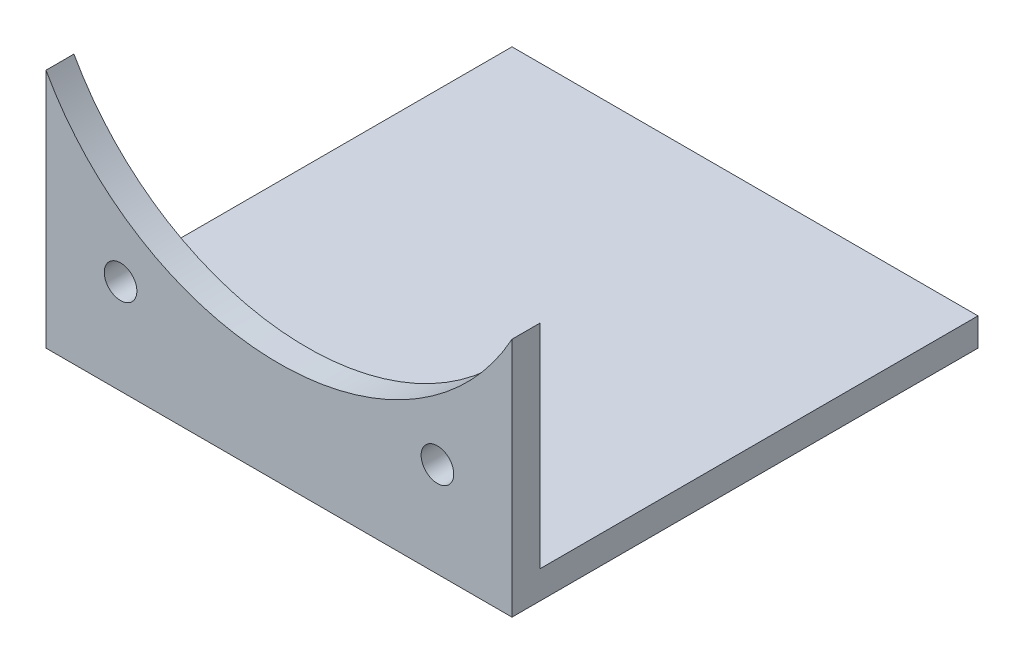
ISO-10303-21;
HEADER;
FILE_DESCRIPTION(('STEP AP214'),'2;1');
FILE_NAME('part.step','',(''),(''),'','','');
FILE_SCHEMA(('AUTOMOTIVE_DESIGN { 1 0 10303 214 1 1 1 1 }'));
ENDSEC;
DATA;
#1=APPLICATION_CONTEXT('core data for automotive mechanical design processes');
#2=APPLICATION_PROTOCOL_DEFINITION('international standard','automotive_design',2000,#1);
#3=PRODUCT_CONTEXT('',#1,'mechanical');
#4=PRODUCT('Part','Part','',(#3));
#5=PRODUCT_RELATED_PRODUCT_CATEGORY('part','',(#4));
#6=PRODUCT_DEFINITION_FORMATION('','',#4);
#7=PRODUCT_DEFINITION_CONTEXT('part definition',#1,'design');
#8=PRODUCT_DEFINITION('design','',#6,#7);
#9=PRODUCT_DEFINITION_SHAPE('','',#8);
#10=(LENGTH_UNIT() NAMED_UNIT(*) SI_UNIT(.MILLI.,.METRE.));
#11=(NAMED_UNIT(*) PLANE_ANGLE_UNIT() SI_UNIT($,.RADIAN.));
#12=(NAMED_UNIT(*) SI_UNIT($,.STERADIAN.) SOLID_ANGLE_UNIT());
#13=UNCERTAINTY_MEASURE_WITH_UNIT(LENGTH_MEASURE(1.E-05),#10,'distance_accuracy_value','');
#14=(GEOMETRIC_REPRESENTATION_CONTEXT(3) GLOBAL_UNCERTAINTY_ASSIGNED_CONTEXT((#13)) GLOBAL_UNIT_ASSIGNED_CONTEXT((#10,
#11,#12)) REPRESENTATION_CONTEXT('',''));
#15=CARTESIAN_POINT('',(0.,0.,0.));
#16=DIRECTION('',(0.,0.,1.));
#17=DIRECTION('',(1.,0.,0.));
#18=AXIS2_PLACEMENT_3D('',#15,#16,#17);
#19=CARTESIAN_POINT('',(25.,0.,0.));
#20=DIRECTION('',(0.,0.,1.));
#21=DIRECTION('',(1.,0.,0.));
#22=AXIS2_PLACEMENT_3D('',#19,#20,#21);
#23=PLANE('',#22);
#24=CARTESIAN_POINT('',(0.,39.6174123424691,0.));
#25=DIRECTION('',(0.,0.,-1.));
#26=DIRECTION('',(-1.,0.,0.));
#27=AXIS2_PLACEMENT_3D('',#24,#25,#26);
#28=CIRCLE('',#27,28.55);
#29=CARTESIAN_POINT('',(25.,25.8296460259115,0.));
#30=VERTEX_POINT('',#29);
#31=CARTESIAN_POINT('',(-25.,25.8296460259115,0.));
#32=VERTEX_POINT('',#31);
#33=EDGE_CURVE('E130',#30,#32,#28,.T.);
#34=ORIENTED_EDGE('',*,*,#33,.T.);
#35=DIRECTION('',(0.,1.,0.));
#36=VECTOR('',#35,1.);
#37=CARTESIAN_POINT('',(-25.,0.,0.));
#38=LINE('',#37,#36);
#39=CARTESIAN_POINT('',(-25.,0.,0.));
#40=VERTEX_POINT('',#39);
#41=EDGE_CURVE('E112',#40,#32,#38,.T.);
#42=ORIENTED_EDGE('',*,*,#41,.F.);
#43=DIRECTION('',(-1.,0.,0.));
#44=VECTOR('',#43,1.);
#45=CARTESIAN_POINT('',(25.,0.,0.));
#46=LINE('',#45,#44);
#47=CARTESIAN_POINT('',(25.,0.,0.));
#48=VERTEX_POINT('',#47);
#49=EDGE_CURVE('E41',#48,#40,#46,.T.);
#50=ORIENTED_EDGE('',*,*,#49,.F.);
#51=DIRECTION('',(0.,1.,0.));
#52=VECTOR('',#51,1.);
#53=CARTESIAN_POINT('',(25.,0.,0.));
#54=LINE('',#53,#52);
#55=EDGE_CURVE('E111',#48,#30,#54,.T.);
#56=ORIENTED_EDGE('',*,*,#55,.T.);
#57=EDGE_LOOP('',(#34,#42,#50,#56));
#58=FACE_BOUND('',#57,.T.);
#59=CARTESIAN_POINT('',(17.,10.1725486137982,0.));
#60=DIRECTION('',(0.,0.,-1.));
#61=DIRECTION('',(-1.,0.,0.));
#62=AXIS2_PLACEMENT_3D('',#59,#60,#61);
#63=CIRCLE('',#62,1.75);
#64=CARTESIAN_POINT('',(15.25,10.1725486137982,0.));
#65=VERTEX_POINT('',#64);
#66=EDGE_CURVE('E135',#65,#65,#63,.T.);
#67=ORIENTED_EDGE('',*,*,#66,.T.);
#68=EDGE_LOOP('',(#67));
#69=FACE_BOUND('',#68,.T.);
#70=CARTESIAN_POINT('',(-17.,10.1725486137982,0.));
#71=DIRECTION('',(0.,0.,-1.));
#72=DIRECTION('',(-1.,0.,0.));
#73=AXIS2_PLACEMENT_3D('',#70,#71,#72);
#74=CIRCLE('',#73,1.75);
#75=CARTESIAN_POINT('',(-18.75,10.1725486137982,0.));
#76=VERTEX_POINT('',#75);
#77=EDGE_CURVE('E126',#76,#76,#74,.T.);
#78=ORIENTED_EDGE('',*,*,#77,.T.);
#79=EDGE_LOOP('',(#78));
#80=FACE_BOUND('',#79,.T.);
#81=ADVANCED_FACE('F33',(#58,#69,#80),#23,.T.);
#82=CARTESIAN_POINT('',(-25.,0.,0.));
#83=DIRECTION('',(1.,0.,0.));
#84=DIRECTION('',(0.,0.,-1.));
#85=AXIS2_PLACEMENT_3D('',#82,#83,#84);
#86=PLANE('',#85);
#87=ORIENTED_EDGE('',*,*,#41,.T.);
#88=DIRECTION('',(0.,0.,-1.));
#89=VECTOR('',#88,1.);
#90=CARTESIAN_POINT('',(-25.,25.8296460259115,0.));
#91=LINE('',#90,#89);
#92=CARTESIAN_POINT('',(-25.,25.8296460259115,-3.));
#93=VERTEX_POINT('',#92);
#94=EDGE_CURVE('E105',#32,#93,#91,.T.);
#95=ORIENTED_EDGE('',*,*,#94,.T.);
#96=DIRECTION('',(0.,1.,0.));
#97=VECTOR('',#96,1.);
#98=CARTESIAN_POINT('',(-25.,0.,-3.));
#99=LINE('',#98,#97);
#100=CARTESIAN_POINT('',(-25.,3.,-3.));
#101=VERTEX_POINT('',#100);
#102=EDGE_CURVE('E88',#101,#93,#99,.T.);
#103=ORIENTED_EDGE('',*,*,#102,.F.);
#104=DIRECTION('',(0.,0.,-1.));
#105=VECTOR('',#104,1.);
#106=CARTESIAN_POINT('',(-25.,3.,-3.));
#107=LINE('',#106,#105);
#108=CARTESIAN_POINT('',(-25.,3.,-50.));
#109=VERTEX_POINT('',#108);
#110=EDGE_CURVE('E101',#101,#109,#107,.T.);
#111=ORIENTED_EDGE('',*,*,#110,.T.);
#112=DIRECTION('',(0.,1.,0.));
#113=VECTOR('',#112,1.);
#114=CARTESIAN_POINT('',(-25.,0.,-50.));
#115=LINE('',#114,#113);
#116=CARTESIAN_POINT('',(-25.,0.,-50.));
#117=VERTEX_POINT('',#116);
#118=EDGE_CURVE('E94',#117,#109,#115,.T.);
#119=ORIENTED_EDGE('',*,*,#118,.F.);
#120=DIRECTION('',(0.,0.,-1.));
#121=VECTOR('',#120,1.);
#122=CARTESIAN_POINT('',(-25.,0.,0.));
#123=LINE('',#122,#121);
#124=EDGE_CURVE('E77',#40,#117,#123,.T.);
#125=ORIENTED_EDGE('',*,*,#124,.F.);
#126=EDGE_LOOP('',(#87,#95,#103,#111,#119,#125));
#127=FACE_BOUND('',#126,.T.);
#128=ADVANCED_FACE('F99',(#127),#86,.F.);
#129=CARTESIAN_POINT('',(25.,0.,0.));
#130=DIRECTION('',(1.,0.,0.));
#131=DIRECTION('',(0.,0.,-1.));
#132=AXIS2_PLACEMENT_3D('',#129,#130,#131);
#133=PLANE('',#132);
#134=DIRECTION('',(0.,0.,-1.));
#135=VECTOR('',#134,1.);
#136=CARTESIAN_POINT('',(25.,25.8296460259115,0.));
#137=LINE('',#136,#135);
#138=CARTESIAN_POINT('',(25.,25.8296460259115,-3.));
#139=VERTEX_POINT('',#138);
#140=EDGE_CURVE('E48',#30,#139,#137,.T.);
#141=ORIENTED_EDGE('',*,*,#140,.F.);
#142=ORIENTED_EDGE('',*,*,#55,.F.);
#143=DIRECTION('',(0.,0.,-1.));
#144=VECTOR('',#143,1.);
#145=CARTESIAN_POINT('',(25.,0.,0.));
#146=LINE('',#145,#144);
#147=CARTESIAN_POINT('',(25.,0.,-50.));
#148=VERTEX_POINT('',#147);
#149=EDGE_CURVE('E114',#48,#148,#146,.T.);
#150=ORIENTED_EDGE('',*,*,#149,.T.);
#151=DIRECTION('',(0.,1.,0.));
#152=VECTOR('',#151,1.);
#153=CARTESIAN_POINT('',(25.,0.,-50.));
#154=LINE('',#153,#152);
#155=CARTESIAN_POINT('',(25.,3.,-50.));
#156=VERTEX_POINT('',#155);
#157=EDGE_CURVE('E96',#148,#156,#154,.T.);
#158=ORIENTED_EDGE('',*,*,#157,.T.);
#159=DIRECTION('',(0.,0.,-1.));
#160=VECTOR('',#159,1.);
#161=CARTESIAN_POINT('',(25.,3.,-3.));
#162=LINE('',#161,#160);
#163=CARTESIAN_POINT('',(25.,3.,-3.));
#164=VERTEX_POINT('',#163);
#165=EDGE_CURVE('E102',#164,#156,#162,.T.);
#166=ORIENTED_EDGE('',*,*,#165,.F.);
#167=DIRECTION('',(0.,1.,0.));
#168=VECTOR('',#167,1.);
#169=CARTESIAN_POINT('',(25.,0.,-3.));
#170=LINE('',#169,#168);
#171=EDGE_CURVE('E119',#164,#139,#170,.T.);
#172=ORIENTED_EDGE('',*,*,#171,.T.);
#173=EDGE_LOOP('',(#141,#142,#150,#158,#166,#172));
#174=FACE_BOUND('',#173,.T.);
#175=ADVANCED_FACE('F157',(#174),#133,.T.);
#176=CARTESIAN_POINT('',(25.,0.,-3.));
#177=DIRECTION('',(0.,0.,1.));
#178=DIRECTION('',(1.,0.,0.));
#179=AXIS2_PLACEMENT_3D('',#176,#177,#178);
#180=PLANE('',#179);
#181=CARTESIAN_POINT('',(17.,10.1725486137982,-3.));
#182=DIRECTION('',(0.,0.,-1.));
#183=DIRECTION('',(-1.,0.,0.));
#184=AXIS2_PLACEMENT_3D('',#181,#182,#183);
#185=CIRCLE('',#184,1.75);
#186=CARTESIAN_POINT('',(15.25,10.1725486137982,-3.));
#187=VERTEX_POINT('',#186);
#188=EDGE_CURVE('E138',#187,#187,#185,.T.);
#189=ORIENTED_EDGE('',*,*,#188,.F.);
#190=EDGE_LOOP('',(#189));
#191=FACE_BOUND('',#190,.T.);
#192=CARTESIAN_POINT('',(-17.,10.1725486137982,-3.));
#193=DIRECTION('',(0.,0.,-1.));
#194=DIRECTION('',(-1.,0.,0.));
#195=AXIS2_PLACEMENT_3D('',#192,#193,#194);
#196=CIRCLE('',#195,1.75);
#197=CARTESIAN_POINT('',(-18.75,10.1725486137982,-3.));
#198=VERTEX_POINT('',#197);
#199=EDGE_CURVE('E127',#198,#198,#196,.T.);
#200=ORIENTED_EDGE('',*,*,#199,.F.);
#201=EDGE_LOOP('',(#200));
#202=FACE_BOUND('',#201,.T.);
#203=ORIENTED_EDGE('',*,*,#102,.T.);
#204=CARTESIAN_POINT('',(0.,39.6174123424691,-3.));
#205=DIRECTION('',(0.,0.,-1.));
#206=DIRECTION('',(-1.,0.,0.));
#207=AXIS2_PLACEMENT_3D('',#204,#205,#206);
#208=CIRCLE('',#207,28.55);
#209=EDGE_CURVE('E133',#139,#93,#208,.T.);
#210=ORIENTED_EDGE('',*,*,#209,.F.);
#211=ORIENTED_EDGE('',*,*,#171,.F.);
#212=DIRECTION('',(-1.,0.,0.));
#213=VECTOR('',#212,1.);
#214=CARTESIAN_POINT('',(25.,3.,-3.));
#215=LINE('',#214,#213);
#216=EDGE_CURVE('E11',#164,#101,#215,.T.);
#217=ORIENTED_EDGE('',*,*,#216,.T.);
#218=EDGE_LOOP('',(#203,#210,#211,#217));
#219=FACE_BOUND('',#218,.T.);
#220=ADVANCED_FACE('F154',(#191,#202,#219),#180,.F.);
#221=CARTESIAN_POINT('',(25.,0.,0.));
#222=DIRECTION('',(0.,1.,0.));
#223=DIRECTION('',(0.,0.,1.));
#224=AXIS2_PLACEMENT_3D('',#221,#222,#223);
#225=PLANE('',#224);
#226=ORIENTED_EDGE('',*,*,#124,.T.);
#227=DIRECTION('',(-1.,0.,0.));
#228=VECTOR('',#227,1.);
#229=CARTESIAN_POINT('',(25.,0.,-50.));
#230=LINE('',#229,#228);
#231=EDGE_CURVE('E81',#148,#117,#230,.T.);
#232=ORIENTED_EDGE('',*,*,#231,.F.);
#233=ORIENTED_EDGE('',*,*,#149,.F.);
#234=ORIENTED_EDGE('',*,*,#49,.T.);
#235=EDGE_LOOP('',(#226,#232,#233,#234));
#236=FACE_BOUND('',#235,.T.);
#237=ADVANCED_FACE('F79',(#236),#225,.F.);
#238=CARTESIAN_POINT('',(25.,0.,-50.));
#239=DIRECTION('',(0.,0.,1.));
#240=DIRECTION('',(1.,0.,0.));
#241=AXIS2_PLACEMENT_3D('',#238,#239,#240);
#242=PLANE('',#241);
#243=ORIENTED_EDGE('',*,*,#118,.T.);
#244=DIRECTION('',(-1.,0.,0.));
#245=VECTOR('',#244,1.);
#246=CARTESIAN_POINT('',(25.,3.,-50.));
#247=LINE('',#246,#245);
#248=EDGE_CURVE('E97',#156,#109,#247,.T.);
#249=ORIENTED_EDGE('',*,*,#248,.F.);
#250=ORIENTED_EDGE('',*,*,#157,.F.);
#251=ORIENTED_EDGE('',*,*,#231,.T.);
#252=EDGE_LOOP('',(#243,#249,#250,#251));
#253=FACE_BOUND('',#252,.T.);
#254=ADVANCED_FACE('F92',(#253),#242,.F.);
#255=CARTESIAN_POINT('',(25.,3.,-3.));
#256=DIRECTION('',(0.,1.,0.));
#257=DIRECTION('',(0.,0.,1.));
#258=AXIS2_PLACEMENT_3D('',#255,#256,#257);
#259=PLANE('',#258);
#260=ORIENTED_EDGE('',*,*,#110,.F.);
#261=ORIENTED_EDGE('',*,*,#216,.F.);
#262=ORIENTED_EDGE('',*,*,#165,.T.);
#263=ORIENTED_EDGE('',*,*,#248,.T.);
#264=EDGE_LOOP('',(#260,#261,#262,#263));
#265=FACE_BOUND('',#264,.T.);
#266=ADVANCED_FACE('F35',(#265),#259,.T.);
#267=CARTESIAN_POINT('',(-17.,10.1725486137982,0.));
#268=DIRECTION('',(0.,0.,-1.));
#269=DIRECTION('',(-1.,0.,0.));
#270=AXIS2_PLACEMENT_3D('',#267,#268,#269);
#271=CYLINDRICAL_SURFACE('',#270,1.75);
#272=ORIENTED_EDGE('',*,*,#77,.F.);
#273=EDGE_LOOP('',(#272));
#274=FACE_BOUND('',#273,.T.);
#275=ORIENTED_EDGE('',*,*,#199,.T.);
#276=EDGE_LOOP('',(#275));
#277=FACE_BOUND('',#276,.T.);
#278=ADVANCED_FACE('F150',(#274,#277),#271,.F.);
#279=CARTESIAN_POINT('',(17.,10.1725486137982,0.));
#280=DIRECTION('',(0.,0.,-1.));
#281=DIRECTION('',(-1.,0.,0.));
#282=AXIS2_PLACEMENT_3D('',#279,#280,#281);
#283=CYLINDRICAL_SURFACE('',#282,1.75);
#284=ORIENTED_EDGE('',*,*,#66,.F.);
#285=EDGE_LOOP('',(#284));
#286=FACE_BOUND('',#285,.T.);
#287=ORIENTED_EDGE('',*,*,#188,.T.);
#288=EDGE_LOOP('',(#287));
#289=FACE_BOUND('',#288,.T.);
#290=ADVANCED_FACE('F146',(#286,#289),#283,.F.);
#291=CARTESIAN_POINT('',(0.,39.6174123424691,0.));
#292=DIRECTION('',(0.,0.,-1.));
#293=DIRECTION('',(-1.,0.,0.));
#294=AXIS2_PLACEMENT_3D('',#291,#292,#293);
#295=CYLINDRICAL_SURFACE('',#294,28.55);
#296=ORIENTED_EDGE('',*,*,#33,.F.);
#297=ORIENTED_EDGE('',*,*,#140,.T.);
#298=ORIENTED_EDGE('',*,*,#209,.T.);
#299=ORIENTED_EDGE('',*,*,#94,.F.);
#300=EDGE_LOOP('',(#296,#297,#298,#299));
#301=FACE_BOUND('',#300,.T.);
#302=ADVANCED_FACE('F149',(#301),#295,.F.);
#303=CLOSED_SHELL('',(#81,#128,#175,#220,#237,#254,#266,#278,#290,#302));
#304=MANIFOLD_SOLID_BREP('B2',#303);
#305=ADVANCED_BREP_SHAPE_REPRESENTATION('',(#18,#304),#14);
#306=SHAPE_DEFINITION_REPRESENTATION(#9,#305);
ENDSEC;
END-ISO-10303-21;
